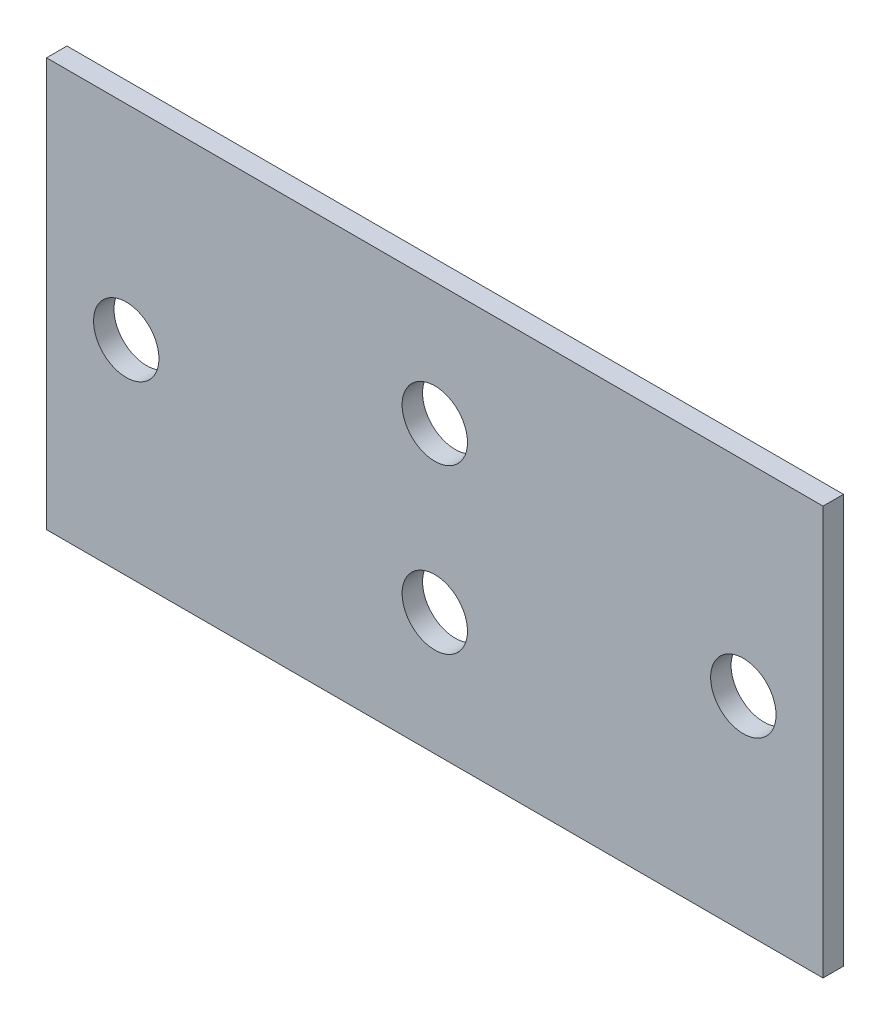
ISO-10303-21;
HEADER;
FILE_DESCRIPTION(('STEP AP214'),'2;1');
FILE_NAME('part.step','',(''),(''),'','','');
FILE_SCHEMA(('AUTOMOTIVE_DESIGN { 1 0 10303 214 1 1 1 1 }'));
ENDSEC;
DATA;
#1=APPLICATION_CONTEXT('core data for automotive mechanical design processes');
#2=APPLICATION_PROTOCOL_DEFINITION('international standard','automotive_design',2000,#1);
#3=PRODUCT_CONTEXT('',#1,'mechanical');
#4=PRODUCT('Part','Part','',(#3));
#5=PRODUCT_RELATED_PRODUCT_CATEGORY('part','',(#4));
#6=PRODUCT_DEFINITION_FORMATION('','',#4);
#7=PRODUCT_DEFINITION_CONTEXT('part definition',#1,'design');
#8=PRODUCT_DEFINITION('design','',#6,#7);
#9=PRODUCT_DEFINITION_SHAPE('','',#8);
#10=(LENGTH_UNIT() NAMED_UNIT(*) SI_UNIT(.MILLI.,.METRE.));
#11=(NAMED_UNIT(*) PLANE_ANGLE_UNIT() SI_UNIT($,.RADIAN.));
#12=(NAMED_UNIT(*) SI_UNIT($,.STERADIAN.) SOLID_ANGLE_UNIT());
#13=UNCERTAINTY_MEASURE_WITH_UNIT(LENGTH_MEASURE(1.E-05),#10,'distance_accuracy_value','');
#14=(GEOMETRIC_REPRESENTATION_CONTEXT(3) GLOBAL_UNCERTAINTY_ASSIGNED_CONTEXT((#13)) GLOBAL_UNIT_ASSIGNED_CONTEXT((#10,
#11,#12)) REPRESENTATION_CONTEXT('',''));
#15=CARTESIAN_POINT('',(0.,0.,0.));
#16=DIRECTION('',(0.,0.,1.));
#17=DIRECTION('',(1.,0.,0.));
#18=AXIS2_PLACEMENT_3D('',#15,#16,#17);
#19=CARTESIAN_POINT('',(0.,0.,0.));
#20=DIRECTION('',(0.,0.,1.));
#21=DIRECTION('',(1.,0.,0.));
#22=AXIS2_PLACEMENT_3D('',#19,#20,#21);
#23=PLANE('',#22);
#24=CARTESIAN_POINT('',(15.1,0.,0.));
#25=DIRECTION('',(0.,0.,1.));
#26=DIRECTION('',(1.,0.,0.));
#27=AXIS2_PLACEMENT_3D('',#24,#25,#26);
#28=CIRCLE('',#27,1.6);
#29=CARTESIAN_POINT('',(16.7,0.,0.));
#30=VERTEX_POINT('',#29);
#31=EDGE_CURVE('E92',#30,#30,#28,.T.);
#32=ORIENTED_EDGE('',*,*,#31,.T.);
#33=EDGE_LOOP('',(#32));
#34=FACE_BOUND('',#33,.T.);
#35=CARTESIAN_POINT('',(-15.1,0.,0.));
#36=DIRECTION('',(0.,0.,1.));
#37=DIRECTION('',(1.,0.,0.));
#38=AXIS2_PLACEMENT_3D('',#35,#36,#37);
#39=CIRCLE('',#38,1.6);
#40=CARTESIAN_POINT('',(-13.5,0.,0.));
#41=VERTEX_POINT('',#40);
#42=EDGE_CURVE('E96',#41,#41,#39,.T.);
#43=ORIENTED_EDGE('',*,*,#42,.T.);
#44=EDGE_LOOP('',(#43));
#45=FACE_BOUND('',#44,.T.);
#46=CARTESIAN_POINT('',(0.,-3.99999999999999,0.));
#47=DIRECTION('',(0.,0.,1.));
#48=DIRECTION('',(1.,0.,0.));
#49=AXIS2_PLACEMENT_3D('',#46,#47,#48);
#50=CIRCLE('',#49,1.6);
#51=CARTESIAN_POINT('',(1.6,-3.99999999999999,0.));
#52=VERTEX_POINT('',#51);
#53=EDGE_CURVE('E98',#52,#52,#50,.T.);
#54=ORIENTED_EDGE('',*,*,#53,.T.);
#55=EDGE_LOOP('',(#54));
#56=FACE_BOUND('',#55,.T.);
#57=CARTESIAN_POINT('',(0.,3.99999999999999,0.));
#58=DIRECTION('',(0.,0.,1.));
#59=DIRECTION('',(1.,0.,0.));
#60=AXIS2_PLACEMENT_3D('',#57,#58,#59);
#61=CIRCLE('',#60,1.6);
#62=CARTESIAN_POINT('',(1.6,3.99999999999999,0.));
#63=VERTEX_POINT('',#62);
#64=EDGE_CURVE('E22',#63,#63,#61,.T.);
#65=ORIENTED_EDGE('',*,*,#64,.T.);
#66=EDGE_LOOP('',(#65));
#67=FACE_BOUND('',#66,.T.);
#68=DIRECTION('',(0.,1.,0.));
#69=VECTOR('',#68,1.);
#70=CARTESIAN_POINT('',(19.,10.,0.));
#71=LINE('',#70,#69);
#72=CARTESIAN_POINT('',(19.,-9.99999999999999,0.));
#73=VERTEX_POINT('',#72);
#74=CARTESIAN_POINT('',(19.,10.,0.));
#75=VERTEX_POINT('',#74);
#76=EDGE_CURVE('E62',#73,#75,#71,.T.);
#77=ORIENTED_EDGE('',*,*,#76,.F.);
#78=DIRECTION('',(1.,0.,0.));
#79=VECTOR('',#78,1.);
#80=CARTESIAN_POINT('',(19.,-9.99999999999999,0.));
#81=LINE('',#80,#79);
#82=CARTESIAN_POINT('',(-19.,-10.,0.));
#83=VERTEX_POINT('',#82);
#84=EDGE_CURVE('E105',#83,#73,#81,.T.);
#85=ORIENTED_EDGE('',*,*,#84,.F.);
#86=DIRECTION('',(0.,-1.,0.));
#87=VECTOR('',#86,1.);
#88=CARTESIAN_POINT('',(-19.,-10.,0.));
#89=LINE('',#88,#87);
#90=CARTESIAN_POINT('',(-19.,10.,0.));
#91=VERTEX_POINT('',#90);
#92=EDGE_CURVE('E72',#91,#83,#89,.T.);
#93=ORIENTED_EDGE('',*,*,#92,.F.);
#94=DIRECTION('',(-1.,0.,0.));
#95=VECTOR('',#94,1.);
#96=CARTESIAN_POINT('',(-19.,10.,0.));
#97=LINE('',#96,#95);
#98=EDGE_CURVE('E57',#75,#91,#97,.T.);
#99=ORIENTED_EDGE('',*,*,#98,.F.);
#100=EDGE_LOOP('',(#77,#85,#93,#99));
#101=FACE_BOUND('',#100,.T.);
#102=ADVANCED_FACE('F19',(#34,#45,#56,#67,#101),#23,.F.);
#103=CARTESIAN_POINT('',(19.,10.,0.));
#104=DIRECTION('',(1.,0.,0.));
#105=DIRECTION('',(0.,0.,-1.));
#106=AXIS2_PLACEMENT_3D('',#103,#104,#105);
#107=PLANE('',#106);
#108=ORIENTED_EDGE('',*,*,#76,.T.);
#109=DIRECTION('',(0.,0.,1.));
#110=VECTOR('',#109,1.);
#111=CARTESIAN_POINT('',(19.,10.,0.));
#112=LINE('',#111,#110);
#113=CARTESIAN_POINT('',(19.,10.,1.));
#114=VERTEX_POINT('',#113);
#115=EDGE_CURVE('E64',#114,#75,#112,.F.);
#116=ORIENTED_EDGE('',*,*,#115,.F.);
#117=DIRECTION('',(0.,1.,0.));
#118=VECTOR('',#117,1.);
#119=CARTESIAN_POINT('',(19.,0.,1.));
#120=LINE('',#119,#118);
#121=CARTESIAN_POINT('',(19.,-9.99999999999999,1.));
#122=VERTEX_POINT('',#121);
#123=EDGE_CURVE('E95',#122,#114,#120,.T.);
#124=ORIENTED_EDGE('',*,*,#123,.F.);
#125=DIRECTION('',(0.,0.,1.));
#126=VECTOR('',#125,1.);
#127=CARTESIAN_POINT('',(19.,-9.99999999999999,0.));
#128=LINE('',#127,#126);
#129=EDGE_CURVE('E67',#73,#122,#128,.T.);
#130=ORIENTED_EDGE('',*,*,#129,.F.);
#131=EDGE_LOOP('',(#108,#116,#124,#130));
#132=FACE_BOUND('',#131,.T.);
#133=ADVANCED_FACE('F63',(#132),#107,.T.);
#134=CARTESIAN_POINT('',(-19.,10.,0.));
#135=DIRECTION('',(0.,1.,0.));
#136=DIRECTION('',(-1.,0.,0.));
#137=AXIS2_PLACEMENT_3D('',#134,#135,#136);
#138=PLANE('',#137);
#139=ORIENTED_EDGE('',*,*,#98,.T.);
#140=DIRECTION('',(0.,0.,1.));
#141=VECTOR('',#140,1.);
#142=CARTESIAN_POINT('',(-19.,10.,0.));
#143=LINE('',#142,#141);
#144=CARTESIAN_POINT('',(-19.,10.,1.));
#145=VERTEX_POINT('',#144);
#146=EDGE_CURVE('E74',#145,#91,#143,.F.);
#147=ORIENTED_EDGE('',*,*,#146,.F.);
#148=DIRECTION('',(1.,0.,0.));
#149=VECTOR('',#148,1.);
#150=CARTESIAN_POINT('',(0.,10.,1.));
#151=LINE('',#150,#149);
#152=EDGE_CURVE('E78',#114,#145,#151,.F.);
#153=ORIENTED_EDGE('',*,*,#152,.F.);
#154=ORIENTED_EDGE('',*,*,#115,.T.);
#155=EDGE_LOOP('',(#139,#147,#153,#154));
#156=FACE_BOUND('',#155,.T.);
#157=ADVANCED_FACE('F76',(#156),#138,.T.);
#158=CARTESIAN_POINT('',(-19.,-10.,0.));
#159=DIRECTION('',(-1.,0.,0.));
#160=DIRECTION('',(0.,-1.,0.));
#161=AXIS2_PLACEMENT_3D('',#158,#159,#160);
#162=PLANE('',#161);
#163=ORIENTED_EDGE('',*,*,#92,.T.);
#164=DIRECTION('',(0.,0.,1.));
#165=VECTOR('',#164,1.);
#166=CARTESIAN_POINT('',(-19.,-9.99999999999999,0.));
#167=LINE('',#166,#165);
#168=CARTESIAN_POINT('',(-19.,-10.,1.));
#169=VERTEX_POINT('',#168);
#170=EDGE_CURVE('E37',#169,#83,#167,.F.);
#171=ORIENTED_EDGE('',*,*,#170,.F.);
#172=DIRECTION('',(0.,1.,0.));
#173=VECTOR('',#172,1.);
#174=CARTESIAN_POINT('',(-19.,0.,1.));
#175=LINE('',#174,#173);
#176=EDGE_CURVE('E116',#145,#169,#175,.F.);
#177=ORIENTED_EDGE('',*,*,#176,.F.);
#178=ORIENTED_EDGE('',*,*,#146,.T.);
#179=EDGE_LOOP('',(#163,#171,#177,#178));
#180=FACE_BOUND('',#179,.T.);
#181=ADVANCED_FACE('F114',(#180),#162,.T.);
#182=CARTESIAN_POINT('',(19.,-9.99999999999999,0.));
#183=DIRECTION('',(0.,-1.,0.));
#184=DIRECTION('',(1.,0.,0.));
#185=AXIS2_PLACEMENT_3D('',#182,#183,#184);
#186=PLANE('',#185);
#187=ORIENTED_EDGE('',*,*,#84,.T.);
#188=ORIENTED_EDGE('',*,*,#129,.T.);
#189=DIRECTION('',(1.,0.,0.));
#190=VECTOR('',#189,1.);
#191=CARTESIAN_POINT('',(0.,-10.,1.));
#192=LINE('',#191,#190);
#193=EDGE_CURVE('E91',#169,#122,#192,.T.);
#194=ORIENTED_EDGE('',*,*,#193,.F.);
#195=ORIENTED_EDGE('',*,*,#170,.T.);
#196=EDGE_LOOP('',(#187,#188,#194,#195));
#197=FACE_BOUND('',#196,.T.);
#198=ADVANCED_FACE('F121',(#197),#186,.T.);
#199=CARTESIAN_POINT('',(0.,3.99999999999999,0.));
#200=DIRECTION('',(0.,0.,1.));
#201=DIRECTION('',(1.,0.,0.));
#202=AXIS2_PLACEMENT_3D('',#199,#200,#201);
#203=CYLINDRICAL_SURFACE('',#202,1.6);
#204=CARTESIAN_POINT('',(0.,3.99999999999999,1.));
#205=DIRECTION('',(0.,0.,1.));
#206=DIRECTION('',(1.,0.,0.));
#207=AXIS2_PLACEMENT_3D('',#204,#205,#206);
#208=CIRCLE('',#207,1.6);
#209=CARTESIAN_POINT('',(1.6,3.99999999999999,1.));
#210=VERTEX_POINT('',#209);
#211=EDGE_CURVE('E88',#210,#210,#208,.F.);
#212=ORIENTED_EDGE('',*,*,#211,.F.);
#213=EDGE_LOOP('',(#212));
#214=FACE_BOUND('',#213,.T.);
#215=ORIENTED_EDGE('',*,*,#64,.F.);
#216=EDGE_LOOP('',(#215));
#217=FACE_BOUND('',#216,.T.);
#218=ADVANCED_FACE('F123',(#214,#217),#203,.F.);
#219=CARTESIAN_POINT('',(0.,-3.99999999999999,0.));
#220=DIRECTION('',(0.,0.,1.));
#221=DIRECTION('',(1.,0.,0.));
#222=AXIS2_PLACEMENT_3D('',#219,#220,#221);
#223=CYLINDRICAL_SURFACE('',#222,1.6);
#224=CARTESIAN_POINT('',(0.,-3.99999999999999,1.));
#225=DIRECTION('',(0.,0.,1.));
#226=DIRECTION('',(1.,0.,0.));
#227=AXIS2_PLACEMENT_3D('',#224,#225,#226);
#228=CIRCLE('',#227,1.6);
#229=CARTESIAN_POINT('',(1.6,-3.99999999999999,1.));
#230=VERTEX_POINT('',#229);
#231=EDGE_CURVE('E85',#230,#230,#228,.F.);
#232=ORIENTED_EDGE('',*,*,#231,.F.);
#233=EDGE_LOOP('',(#232));
#234=FACE_BOUND('',#233,.T.);
#235=ORIENTED_EDGE('',*,*,#53,.F.);
#236=EDGE_LOOP('',(#235));
#237=FACE_BOUND('',#236,.T.);
#238=ADVANCED_FACE('F130',(#234,#237),#223,.F.);
#239=CARTESIAN_POINT('',(-15.1,0.,0.));
#240=DIRECTION('',(0.,0.,1.));
#241=DIRECTION('',(1.,0.,0.));
#242=AXIS2_PLACEMENT_3D('',#239,#240,#241);
#243=CYLINDRICAL_SURFACE('',#242,1.6);
#244=CARTESIAN_POINT('',(-15.1,0.,1.));
#245=DIRECTION('',(0.,0.,1.));
#246=DIRECTION('',(1.,0.,0.));
#247=AXIS2_PLACEMENT_3D('',#244,#245,#246);
#248=CIRCLE('',#247,1.6);
#249=CARTESIAN_POINT('',(-13.5,0.,1.));
#250=VERTEX_POINT('',#249);
#251=EDGE_CURVE('E28',#250,#250,#248,.F.);
#252=ORIENTED_EDGE('',*,*,#251,.F.);
#253=EDGE_LOOP('',(#252));
#254=FACE_BOUND('',#253,.T.);
#255=ORIENTED_EDGE('',*,*,#42,.F.);
#256=EDGE_LOOP('',(#255));
#257=FACE_BOUND('',#256,.T.);
#258=ADVANCED_FACE('F141',(#254,#257),#243,.F.);
#259=CARTESIAN_POINT('',(15.1,0.,0.));
#260=DIRECTION('',(0.,0.,1.));
#261=DIRECTION('',(1.,0.,0.));
#262=AXIS2_PLACEMENT_3D('',#259,#260,#261);
#263=CYLINDRICAL_SURFACE('',#262,1.6);
#264=CARTESIAN_POINT('',(15.1,0.,1.));
#265=DIRECTION('',(0.,0.,1.));
#266=DIRECTION('',(1.,0.,0.));
#267=AXIS2_PLACEMENT_3D('',#264,#265,#266);
#268=CIRCLE('',#267,1.6);
#269=CARTESIAN_POINT('',(16.7,0.,1.));
#270=VERTEX_POINT('',#269);
#271=EDGE_CURVE('E11',#270,#270,#268,.F.);
#272=ORIENTED_EDGE('',*,*,#271,.F.);
#273=EDGE_LOOP('',(#272));
#274=FACE_BOUND('',#273,.T.);
#275=ORIENTED_EDGE('',*,*,#31,.F.);
#276=EDGE_LOOP('',(#275));
#277=FACE_BOUND('',#276,.T.);
#278=ADVANCED_FACE('F135',(#274,#277),#263,.F.);
#279=CARTESIAN_POINT('',(0.,0.,1.));
#280=DIRECTION('',(0.,0.,1.));
#281=DIRECTION('',(1.,0.,0.));
#282=AXIS2_PLACEMENT_3D('',#279,#280,#281);
#283=PLANE('',#282);
#284=ORIENTED_EDGE('',*,*,#271,.T.);
#285=EDGE_LOOP('',(#284));
#286=FACE_BOUND('',#285,.T.);
#287=ORIENTED_EDGE('',*,*,#251,.T.);
#288=EDGE_LOOP('',(#287));
#289=FACE_BOUND('',#288,.T.);
#290=ORIENTED_EDGE('',*,*,#231,.T.);
#291=EDGE_LOOP('',(#290));
#292=FACE_BOUND('',#291,.T.);
#293=ORIENTED_EDGE('',*,*,#211,.T.);
#294=EDGE_LOOP('',(#293));
#295=FACE_BOUND('',#294,.T.);
#296=ORIENTED_EDGE('',*,*,#176,.T.);
#297=ORIENTED_EDGE('',*,*,#193,.T.);
#298=ORIENTED_EDGE('',*,*,#123,.T.);
#299=ORIENTED_EDGE('',*,*,#152,.T.);
#300=EDGE_LOOP('',(#296,#297,#298,#299));
#301=FACE_BOUND('',#300,.T.);
#302=ADVANCED_FACE('F119',(#286,#289,#292,#295,#301),#283,.T.);
#303=CLOSED_SHELL('',(#102,#133,#157,#181,#198,#218,#238,#258,#278,#302));
#304=MANIFOLD_SOLID_BREP('B1',#303);
#305=ADVANCED_BREP_SHAPE_REPRESENTATION('',(#18,#304),#14);
#306=SHAPE_DEFINITION_REPRESENTATION(#9,#305);
ENDSEC;
END-ISO-10303-21;
